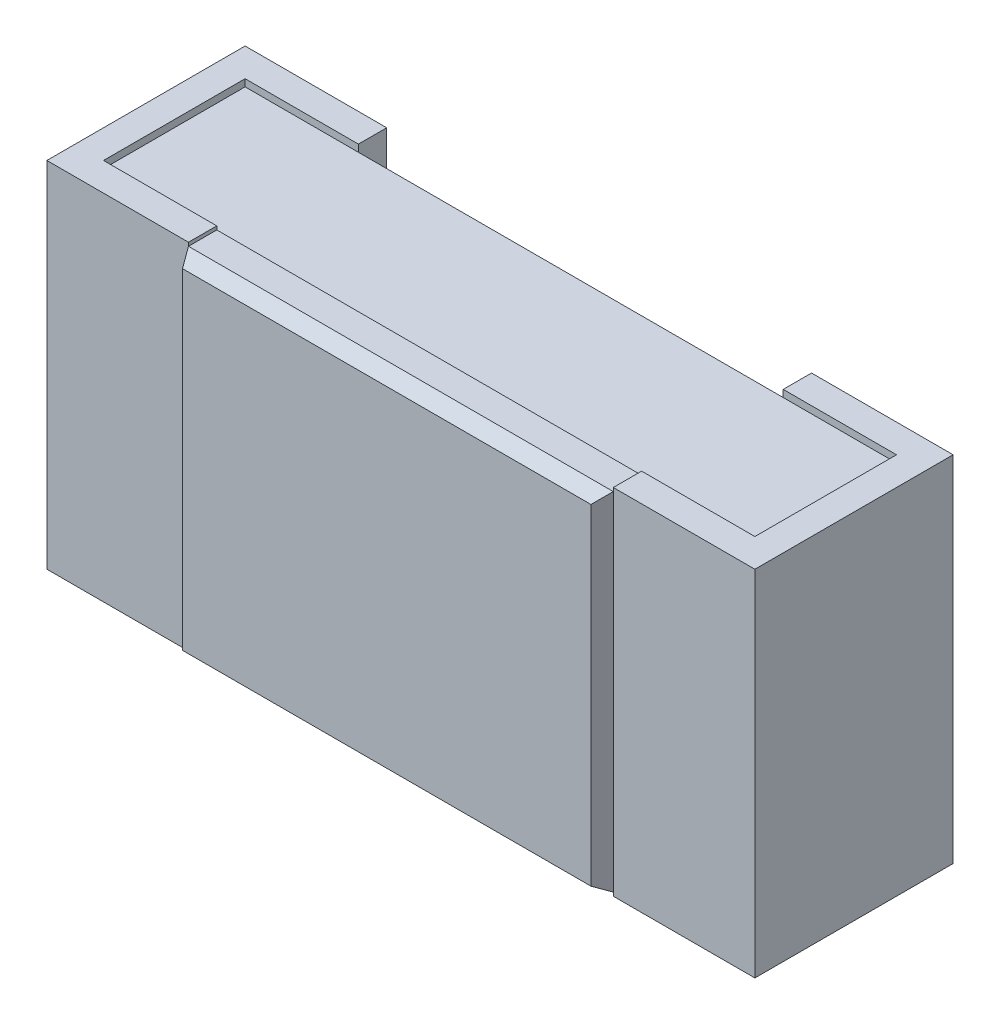
ISO-10303-21;
HEADER;
FILE_DESCRIPTION(('STEP AP214'),'2;1');
FILE_NAME('part.step','',(''),(''),'','','');
FILE_SCHEMA(('AUTOMOTIVE_DESIGN { 1 0 10303 214 1 1 1 1 }'));
ENDSEC;
DATA;
#1=APPLICATION_CONTEXT('core data for automotive mechanical design processes');
#2=APPLICATION_PROTOCOL_DEFINITION('international standard','automotive_design',2000,#1);
#3=PRODUCT_CONTEXT('',#1,'mechanical');
#4=PRODUCT('Part','Part','',(#3));
#5=PRODUCT_RELATED_PRODUCT_CATEGORY('part','',(#4));
#6=PRODUCT_DEFINITION_FORMATION('','',#4);
#7=PRODUCT_DEFINITION_CONTEXT('part definition',#1,'design');
#8=PRODUCT_DEFINITION('design','',#6,#7);
#9=PRODUCT_DEFINITION_SHAPE('','',#8);
#10=(LENGTH_UNIT() NAMED_UNIT(*) SI_UNIT(.MILLI.,.METRE.));
#11=(NAMED_UNIT(*) PLANE_ANGLE_UNIT() SI_UNIT($,.RADIAN.));
#12=(NAMED_UNIT(*) SI_UNIT($,.STERADIAN.) SOLID_ANGLE_UNIT());
#13=UNCERTAINTY_MEASURE_WITH_UNIT(LENGTH_MEASURE(1.E-05),#10,'distance_accuracy_value','');
#14=(GEOMETRIC_REPRESENTATION_CONTEXT(3) GLOBAL_UNCERTAINTY_ASSIGNED_CONTEXT((#13)) GLOBAL_UNIT_ASSIGNED_CONTEXT((#10,
#11,#12)) REPRESENTATION_CONTEXT('',''));
#15=CARTESIAN_POINT('',(0.,0.,0.));
#16=DIRECTION('',(0.,0.,1.));
#17=DIRECTION('',(1.,0.,0.));
#18=AXIS2_PLACEMENT_3D('',#15,#16,#17);
#19=CARTESIAN_POINT('',(-0.3,-0.25,0.28));
#20=DIRECTION('',(1.,0.,0.));
#21=DIRECTION('',(0.,0.,-1.));
#22=AXIS2_PLACEMENT_3D('',#19,#20,#21);
#23=PLANE('',#22);
#24=DIRECTION('',(0.,0.,1.));
#25=VECTOR('',#24,1.);
#26=CARTESIAN_POINT('',(-0.3,-0.245,0.24));
#27=LINE('',#26,#25);
#28=CARTESIAN_POINT('',(-0.3,-0.245,0.24));
#29=VERTEX_POINT('',#28);
#30=CARTESIAN_POINT('',(-0.3,-0.245,0.28));
#31=VERTEX_POINT('',#30);
#32=EDGE_CURVE('E290',#29,#31,#27,.T.);
#33=ORIENTED_EDGE('',*,*,#32,.T.);
#34=DIRECTION('',(0.,1.,0.));
#35=VECTOR('',#34,1.);
#36=CARTESIAN_POINT('',(-0.3,-0.25,0.28));
#37=LINE('',#36,#35);
#38=CARTESIAN_POINT('',(-0.3,-0.25,0.28));
#39=VERTEX_POINT('',#38);
#40=EDGE_CURVE('E482',#39,#31,#37,.T.);
#41=ORIENTED_EDGE('',*,*,#40,.F.);
#42=DIRECTION('',(0.,0.,-1.));
#43=VECTOR('',#42,1.);
#44=CARTESIAN_POINT('',(-0.3,-0.25,0.28));
#45=LINE('',#44,#43);
#46=CARTESIAN_POINT('',(-0.3,-0.25,0.24));
#47=VERTEX_POINT('',#46);
#48=EDGE_CURVE('E433',#39,#47,#45,.T.);
#49=ORIENTED_EDGE('',*,*,#48,.T.);
#50=DIRECTION('',(0.,1.,0.));
#51=VECTOR('',#50,1.);
#52=CARTESIAN_POINT('',(-0.3,-0.25,0.24));
#53=LINE('',#52,#51);
#54=EDGE_CURVE('E58',#47,#29,#53,.T.);
#55=ORIENTED_EDGE('',*,*,#54,.T.);
#56=EDGE_LOOP('',(#33,#41,#49,#55));
#57=FACE_BOUND('',#56,.T.);
#58=ADVANCED_FACE('F34',(#57),#23,.T.);
#59=CARTESIAN_POINT('',(0.3,-0.25,0.28));
#60=DIRECTION('',(-1.,0.,0.));
#61=DIRECTION('',(0.,0.,1.));
#62=AXIS2_PLACEMENT_3D('',#59,#60,#61);
#63=PLANE('',#62);
#64=DIRECTION('',(0.,0.,1.));
#65=VECTOR('',#64,1.);
#66=CARTESIAN_POINT('',(0.3,-0.245,0.24));
#67=LINE('',#66,#65);
#68=CARTESIAN_POINT('',(0.3,-0.245,0.24));
#69=VERTEX_POINT('',#68);
#70=CARTESIAN_POINT('',(0.3,-0.245,0.28));
#71=VERTEX_POINT('',#70);
#72=EDGE_CURVE('E286',#69,#71,#67,.T.);
#73=ORIENTED_EDGE('',*,*,#72,.F.);
#74=DIRECTION('',(0.,1.,0.));
#75=VECTOR('',#74,1.);
#76=CARTESIAN_POINT('',(0.3,-0.25,0.24));
#77=LINE('',#76,#75);
#78=CARTESIAN_POINT('',(0.3,-0.25,0.24));
#79=VERTEX_POINT('',#78);
#80=EDGE_CURVE('E361',#79,#69,#77,.T.);
#81=ORIENTED_EDGE('',*,*,#80,.F.);
#82=DIRECTION('',(0.,0.,1.));
#83=VECTOR('',#82,1.);
#84=CARTESIAN_POINT('',(0.3,-0.25,0.28));
#85=LINE('',#84,#83);
#86=CARTESIAN_POINT('',(0.3,-0.25,0.28));
#87=VERTEX_POINT('',#86);
#88=EDGE_CURVE('E328',#79,#87,#85,.T.);
#89=ORIENTED_EDGE('',*,*,#88,.T.);
#90=DIRECTION('',(0.,1.,0.));
#91=VECTOR('',#90,1.);
#92=CARTESIAN_POINT('',(0.3,-0.25,0.28));
#93=LINE('',#92,#91);
#94=EDGE_CURVE('E390',#87,#71,#93,.T.);
#95=ORIENTED_EDGE('',*,*,#94,.T.);
#96=EDGE_LOOP('',(#73,#81,#89,#95));
#97=FACE_BOUND('',#96,.T.);
#98=ADVANCED_FACE('F583',(#97),#63,.T.);
#99=CARTESIAN_POINT('',(-0.46,0.24,0.24));
#100=DIRECTION('',(0.,-1.,0.));
#101=DIRECTION('',(0.,0.,-1.));
#102=AXIS2_PLACEMENT_3D('',#99,#100,#101);
#103=PLANE('',#102);
#104=DIRECTION('',(-1.,0.,0.));
#105=VECTOR('',#104,1.);
#106=CARTESIAN_POINT('',(-0.46,0.24,0.04));
#107=LINE('',#106,#105);
#108=CARTESIAN_POINT('',(0.46,0.24,0.04));
#109=VERTEX_POINT('',#108);
#110=CARTESIAN_POINT('',(0.3,0.24,0.04));
#111=VERTEX_POINT('',#110);
#112=EDGE_CURVE('E497',#109,#111,#107,.T.);
#113=ORIENTED_EDGE('',*,*,#112,.T.);
#114=CARTESIAN_POINT('',(-0.3,0.24,0.04));
#115=VERTEX_POINT('',#114);
#116=EDGE_CURVE('E502',#111,#115,#107,.T.);
#117=ORIENTED_EDGE('',*,*,#116,.T.);
#118=CARTESIAN_POINT('',(-0.46,0.24,0.04));
#119=VERTEX_POINT('',#118);
#120=EDGE_CURVE('E460',#115,#119,#107,.T.);
#121=ORIENTED_EDGE('',*,*,#120,.T.);
#122=DIRECTION('',(0.,0.,-1.));
#123=VECTOR('',#122,1.);
#124=CARTESIAN_POINT('',(-0.46,0.24,0.24));
#125=LINE('',#124,#123);
#126=CARTESIAN_POINT('',(-0.46,0.24,0.24));
#127=VERTEX_POINT('',#126);
#128=EDGE_CURVE('E513',#127,#119,#125,.T.);
#129=ORIENTED_EDGE('',*,*,#128,.F.);
#130=DIRECTION('',(-1.,0.,0.));
#131=VECTOR('',#130,1.);
#132=CARTESIAN_POINT('',(-0.46,0.24,0.24));
#133=LINE('',#132,#131);
#134=CARTESIAN_POINT('',(0.46,0.24,0.24));
#135=VERTEX_POINT('',#134);
#136=EDGE_CURVE('E489',#135,#127,#133,.T.);
#137=ORIENTED_EDGE('',*,*,#136,.F.);
#138=DIRECTION('',(0.,0.,-1.));
#139=VECTOR('',#138,1.);
#140=CARTESIAN_POINT('',(0.46,0.24,0.24));
#141=LINE('',#140,#139);
#142=EDGE_CURVE('E516',#135,#109,#141,.T.);
#143=ORIENTED_EDGE('',*,*,#142,.T.);
#144=EDGE_LOOP('',(#113,#117,#121,#129,#137,#143));
#145=FACE_BOUND('',#144,.T.);
#146=ADVANCED_FACE('F36',(#145),#103,.F.);
#147=CARTESIAN_POINT('',(-0.46,-0.24,0.24));
#148=DIRECTION('',(0.,1.,0.));
#149=DIRECTION('',(0.,0.,1.));
#150=AXIS2_PLACEMENT_3D('',#147,#148,#149);
#151=PLANE('',#150);
#152=DIRECTION('',(1.,0.,0.));
#153=VECTOR('',#152,1.);
#154=CARTESIAN_POINT('',(-0.46,-0.24,0.04));
#155=LINE('',#154,#153);
#156=CARTESIAN_POINT('',(-0.46,-0.24,0.04));
#157=VERTEX_POINT('',#156);
#158=CARTESIAN_POINT('',(-0.3,-0.24,0.04));
#159=VERTEX_POINT('',#158);
#160=EDGE_CURVE('E493',#157,#159,#155,.T.);
#161=ORIENTED_EDGE('',*,*,#160,.T.);
#162=CARTESIAN_POINT('',(0.3,-0.24,0.04));
#163=VERTEX_POINT('',#162);
#164=EDGE_CURVE('E506',#159,#163,#155,.T.);
#165=ORIENTED_EDGE('',*,*,#164,.T.);
#166=CARTESIAN_POINT('',(0.46,-0.24,0.04));
#167=VERTEX_POINT('',#166);
#168=EDGE_CURVE('E501',#163,#167,#155,.T.);
#169=ORIENTED_EDGE('',*,*,#168,.T.);
#170=DIRECTION('',(0.,0.,-1.));
#171=VECTOR('',#170,1.);
#172=CARTESIAN_POINT('',(0.46,-0.24,0.24));
#173=LINE('',#172,#171);
#174=CARTESIAN_POINT('',(0.46,-0.24,0.24));
#175=VERTEX_POINT('',#174);
#176=EDGE_CURVE('E496',#175,#167,#173,.T.);
#177=ORIENTED_EDGE('',*,*,#176,.F.);
#178=DIRECTION('',(1.,0.,0.));
#179=VECTOR('',#178,1.);
#180=CARTESIAN_POINT('',(-0.46,-0.24,0.24));
#181=LINE('',#180,#179);
#182=CARTESIAN_POINT('',(-0.46,-0.24,0.24));
#183=VERTEX_POINT('',#182);
#184=EDGE_CURVE('E492',#183,#175,#181,.T.);
#185=ORIENTED_EDGE('',*,*,#184,.F.);
#186=DIRECTION('',(0.,0.,-1.));
#187=VECTOR('',#186,1.);
#188=CARTESIAN_POINT('',(-0.46,-0.24,0.24));
#189=LINE('',#188,#187);
#190=EDGE_CURVE('E509',#183,#157,#189,.T.);
#191=ORIENTED_EDGE('',*,*,#190,.T.);
#192=EDGE_LOOP('',(#161,#165,#169,#177,#185,#191));
#193=FACE_BOUND('',#192,.T.);
#194=ADVANCED_FACE('F549',(#193),#151,.F.);
#195=CARTESIAN_POINT('',(0.46,-0.24,0.04));
#196=DIRECTION('',(0.,0.,1.));
#197=DIRECTION('',(1.,0.,0.));
#198=AXIS2_PLACEMENT_3D('',#195,#196,#197);
#199=PLANE('',#198);
#200=ORIENTED_EDGE('',*,*,#116,.F.);
#201=DIRECTION('',(0.,-1.,0.));
#202=VECTOR('',#201,1.);
#203=CARTESIAN_POINT('',(0.3,-0.24,0.04));
#204=LINE('',#203,#202);
#205=EDGE_CURVE('E11',#111,#163,#204,.T.);
#206=ORIENTED_EDGE('',*,*,#205,.T.);
#207=ORIENTED_EDGE('',*,*,#164,.F.);
#208=DIRECTION('',(0.,1.,0.));
#209=VECTOR('',#208,1.);
#210=CARTESIAN_POINT('',(-0.3,-0.24,0.04));
#211=LINE('',#210,#209);
#212=EDGE_CURVE('E43',#159,#115,#211,.T.);
#213=ORIENTED_EDGE('',*,*,#212,.T.);
#214=EDGE_LOOP('',(#200,#206,#207,#213));
#215=FACE_BOUND('',#214,.T.);
#216=ADVANCED_FACE('F525',(#215),#199,.F.);
#217=CARTESIAN_POINT('',(-0.46,-0.25,0.04));
#218=DIRECTION('',(0.,0.,1.));
#219=DIRECTION('',(1.,0.,0.));
#220=AXIS2_PLACEMENT_3D('',#217,#218,#219);
#221=PLANE('',#220);
#222=ORIENTED_EDGE('',*,*,#120,.F.);
#223=DIRECTION('',(0.,1.,0.));
#224=VECTOR('',#223,1.);
#225=CARTESIAN_POINT('',(-0.3,-0.25,0.04));
#226=LINE('',#225,#224);
#227=CARTESIAN_POINT('',(-0.3,0.25,0.04));
#228=VERTEX_POINT('',#227);
#229=EDGE_CURVE('E468',#115,#228,#226,.T.);
#230=ORIENTED_EDGE('',*,*,#229,.T.);
#231=DIRECTION('',(1.,0.,0.));
#232=VECTOR('',#231,1.);
#233=CARTESIAN_POINT('',(-0.46,0.25,0.04));
#234=LINE('',#233,#232);
#235=CARTESIAN_POINT('',(-0.46,0.25,0.04));
#236=VERTEX_POINT('',#235);
#237=EDGE_CURVE('E413',#236,#228,#234,.T.);
#238=ORIENTED_EDGE('',*,*,#237,.F.);
#239=DIRECTION('',(0.,1.,0.));
#240=VECTOR('',#239,1.);
#241=CARTESIAN_POINT('',(-0.46,-0.25,0.04));
#242=LINE('',#241,#240);
#243=EDGE_CURVE('E473',#119,#236,#242,.T.);
#244=ORIENTED_EDGE('',*,*,#243,.F.);
#245=EDGE_LOOP('',(#222,#230,#238,#244));
#246=FACE_BOUND('',#245,.T.);
#247=ADVANCED_FACE('F636',(#246),#221,.T.);
#248=ORIENTED_EDGE('',*,*,#160,.F.);
#249=CARTESIAN_POINT('',(-0.46,-0.25,0.04));
#250=VERTEX_POINT('',#249);
#251=EDGE_CURVE('E469',#250,#157,#242,.T.);
#252=ORIENTED_EDGE('',*,*,#251,.F.);
#253=DIRECTION('',(1.,0.,0.));
#254=VECTOR('',#253,1.);
#255=CARTESIAN_POINT('',(-0.46,-0.25,0.04));
#256=LINE('',#255,#254);
#257=CARTESIAN_POINT('',(-0.3,-0.25,0.04));
#258=VERTEX_POINT('',#257);
#259=EDGE_CURVE('E444',#250,#258,#256,.T.);
#260=ORIENTED_EDGE('',*,*,#259,.T.);
#261=EDGE_CURVE('E464',#258,#159,#226,.T.);
#262=ORIENTED_EDGE('',*,*,#261,.T.);
#263=EDGE_LOOP('',(#248,#252,#260,#262));
#264=FACE_BOUND('',#263,.T.);
#265=ADVANCED_FACE('F534',(#264),#221,.T.);
#266=CARTESIAN_POINT('',(-0.3,-0.25,0.24));
#267=DIRECTION('',(0.,0.,-1.));
#268=DIRECTION('',(-1.,0.,0.));
#269=AXIS2_PLACEMENT_3D('',#266,#267,#268);
#270=PLANE('',#269);
#271=ORIENTED_EDGE('',*,*,#136,.T.);
#272=DIRECTION('',(0.,1.,0.));
#273=VECTOR('',#272,1.);
#274=CARTESIAN_POINT('',(-0.46,-0.25,0.24));
#275=LINE('',#274,#273);
#276=CARTESIAN_POINT('',(-0.46,0.25,0.24));
#277=VERTEX_POINT('',#276);
#278=EDGE_CURVE('E478',#127,#277,#275,.T.);
#279=ORIENTED_EDGE('',*,*,#278,.T.);
#280=DIRECTION('',(-1.,0.,0.));
#281=VECTOR('',#280,1.);
#282=CARTESIAN_POINT('',(-0.3,0.25,0.24));
#283=LINE('',#282,#281);
#284=CARTESIAN_POINT('',(-0.3,0.25,0.24));
#285=VERTEX_POINT('',#284);
#286=EDGE_CURVE('E405',#285,#277,#283,.T.);
#287=ORIENTED_EDGE('',*,*,#286,.F.);
#288=CARTESIAN_POINT('',(-0.3,0.245,0.24));
#289=VERTEX_POINT('',#288);
#290=EDGE_CURVE('E481',#289,#285,#53,.T.);
#291=ORIENTED_EDGE('',*,*,#290,.F.);
#292=DIRECTION('',(-1.,0.,0.));
#293=VECTOR('',#292,1.);
#294=CARTESIAN_POINT('',(-0.3,0.245,0.24));
#295=LINE('',#294,#293);
#296=CARTESIAN_POINT('',(0.3,0.245,0.24));
#297=VERTEX_POINT('',#296);
#298=EDGE_CURVE('E267',#297,#289,#295,.T.);
#299=ORIENTED_EDGE('',*,*,#298,.F.);
#300=CARTESIAN_POINT('',(0.3,0.25,0.24));
#301=VERTEX_POINT('',#300);
#302=EDGE_CURVE('E366',#297,#301,#77,.T.);
#303=ORIENTED_EDGE('',*,*,#302,.T.);
#304=DIRECTION('',(-1.,0.,0.));
#305=VECTOR('',#304,1.);
#306=CARTESIAN_POINT('',(0.3,0.25,0.24));
#307=LINE('',#306,#305);
#308=CARTESIAN_POINT('',(0.46,0.25,0.24));
#309=VERTEX_POINT('',#308);
#310=EDGE_CURVE('E324',#309,#301,#307,.T.);
#311=ORIENTED_EDGE('',*,*,#310,.F.);
#312=DIRECTION('',(0.,1.,0.));
#313=VECTOR('',#312,1.);
#314=CARTESIAN_POINT('',(0.46,-0.25,0.24));
#315=LINE('',#314,#313);
#316=EDGE_CURVE('E371',#135,#309,#315,.T.);
#317=ORIENTED_EDGE('',*,*,#316,.F.);
#318=EDGE_LOOP('',(#271,#279,#287,#291,#299,#303,#311,#317));
#319=FACE_BOUND('',#318,.T.);
#320=ADVANCED_FACE('F603',(#319),#270,.T.);
#321=ORIENTED_EDGE('',*,*,#184,.T.);
#322=CARTESIAN_POINT('',(0.46,-0.25,0.24));
#323=VERTEX_POINT('',#322);
#324=EDGE_CURVE('E367',#323,#175,#315,.T.);
#325=ORIENTED_EDGE('',*,*,#324,.F.);
#326=DIRECTION('',(-1.,0.,0.));
#327=VECTOR('',#326,1.);
#328=CARTESIAN_POINT('',(0.3,-0.25,0.24));
#329=LINE('',#328,#327);
#330=EDGE_CURVE('E356',#323,#79,#329,.T.);
#331=ORIENTED_EDGE('',*,*,#330,.T.);
#332=ORIENTED_EDGE('',*,*,#80,.T.);
#333=DIRECTION('',(1.,0.,0.));
#334=VECTOR('',#333,1.);
#335=CARTESIAN_POINT('',(-0.3,-0.245,0.24));
#336=LINE('',#335,#334);
#337=EDGE_CURVE('E271',#29,#69,#336,.T.);
#338=ORIENTED_EDGE('',*,*,#337,.F.);
#339=ORIENTED_EDGE('',*,*,#54,.F.);
#340=DIRECTION('',(-1.,0.,0.));
#341=VECTOR('',#340,1.);
#342=CARTESIAN_POINT('',(-0.3,-0.25,0.24));
#343=LINE('',#342,#341);
#344=CARTESIAN_POINT('',(-0.46,-0.25,0.24));
#345=VERTEX_POINT('',#344);
#346=EDGE_CURVE('E436',#47,#345,#343,.T.);
#347=ORIENTED_EDGE('',*,*,#346,.T.);
#348=EDGE_CURVE('E474',#345,#183,#275,.T.);
#349=ORIENTED_EDGE('',*,*,#348,.T.);
#350=EDGE_LOOP('',(#321,#325,#331,#332,#338,#339,#347,#349));
#351=FACE_BOUND('',#350,.T.);
#352=ADVANCED_FACE('F546',(#351),#270,.T.);
#353=CARTESIAN_POINT('',(-0.46,-0.25,0.04));
#354=DIRECTION('',(1.,0.,0.));
#355=DIRECTION('',(0.,0.,-1.));
#356=AXIS2_PLACEMENT_3D('',#353,#354,#355);
#357=PLANE('',#356);
#358=ORIENTED_EDGE('',*,*,#128,.T.);
#359=ORIENTED_EDGE('',*,*,#243,.T.);
#360=DIRECTION('',(0.,0.,-1.));
#361=VECTOR('',#360,1.);
#362=CARTESIAN_POINT('',(-0.46,0.25,0.04));
#363=LINE('',#362,#361);
#364=EDGE_CURVE('E409',#277,#236,#363,.T.);
#365=ORIENTED_EDGE('',*,*,#364,.F.);
#366=ORIENTED_EDGE('',*,*,#278,.F.);
#367=EDGE_LOOP('',(#358,#359,#365,#366));
#368=FACE_BOUND('',#367,.T.);
#369=ADVANCED_FACE('F632',(#368),#357,.T.);
#370=ORIENTED_EDGE('',*,*,#190,.F.);
#371=ORIENTED_EDGE('',*,*,#348,.F.);
#372=DIRECTION('',(0.,0.,-1.));
#373=VECTOR('',#372,1.);
#374=CARTESIAN_POINT('',(-0.46,-0.25,0.04));
#375=LINE('',#374,#373);
#376=EDGE_CURVE('E440',#345,#250,#375,.T.);
#377=ORIENTED_EDGE('',*,*,#376,.T.);
#378=ORIENTED_EDGE('',*,*,#251,.T.);
#379=EDGE_LOOP('',(#370,#371,#377,#378));
#380=FACE_BOUND('',#379,.T.);
#381=ADVANCED_FACE('F543',(#380),#357,.T.);
#382=CARTESIAN_POINT('',(-0.5,-0.25,0.));
#383=DIRECTION('',(-1.,0.,0.));
#384=DIRECTION('',(0.,0.,1.));
#385=AXIS2_PLACEMENT_3D('',#382,#383,#384);
#386=PLANE('',#385);
#387=DIRECTION('',(0.,1.,0.));
#388=VECTOR('',#387,1.);
#389=CARTESIAN_POINT('',(-0.5,-0.25,0.28));
#390=LINE('',#389,#388);
#391=CARTESIAN_POINT('',(-0.5,-0.25,0.28));
#392=VERTEX_POINT('',#391);
#393=CARTESIAN_POINT('',(-0.5,0.25,0.28));
#394=VERTEX_POINT('',#393);
#395=EDGE_CURVE('E456',#392,#394,#390,.T.);
#396=ORIENTED_EDGE('',*,*,#395,.T.);
#397=DIRECTION('',(0.,0.,1.));
#398=VECTOR('',#397,1.);
#399=CARTESIAN_POINT('',(-0.5,0.25,0.));
#400=LINE('',#399,#398);
#401=CARTESIAN_POINT('',(-0.5,0.25,0.));
#402=VERTEX_POINT('',#401);
#403=EDGE_CURVE('E365',#402,#394,#400,.T.);
#404=ORIENTED_EDGE('',*,*,#403,.F.);
#405=DIRECTION('',(0.,1.,0.));
#406=VECTOR('',#405,1.);
#407=CARTESIAN_POINT('',(-0.5,-0.25,0.));
#408=LINE('',#407,#406);
#409=CARTESIAN_POINT('',(-0.5,-0.25,0.));
#410=VERTEX_POINT('',#409);
#411=EDGE_CURVE('E457',#410,#402,#408,.T.);
#412=ORIENTED_EDGE('',*,*,#411,.F.);
#413=DIRECTION('',(0.,0.,1.));
#414=VECTOR('',#413,1.);
#415=CARTESIAN_POINT('',(-0.5,-0.25,0.));
#416=LINE('',#415,#414);
#417=EDGE_CURVE('E425',#410,#392,#416,.T.);
#418=ORIENTED_EDGE('',*,*,#417,.T.);
#419=EDGE_LOOP('',(#396,#404,#412,#418));
#420=FACE_BOUND('',#419,.T.);
#421=ADVANCED_FACE('F646',(#420),#386,.T.);
#422=CARTESIAN_POINT('',(-0.5,-0.25,0.));
#423=DIRECTION('',(0.,0.,-1.));
#424=DIRECTION('',(-1.,0.,0.));
#425=AXIS2_PLACEMENT_3D('',#422,#423,#424);
#426=PLANE('',#425);
#427=ORIENTED_EDGE('',*,*,#411,.T.);
#428=DIRECTION('',(-1.,0.,0.));
#429=VECTOR('',#428,1.);
#430=CARTESIAN_POINT('',(-0.5,0.25,0.));
#431=LINE('',#430,#429);
#432=CARTESIAN_POINT('',(-0.3,0.25,0.));
#433=VERTEX_POINT('',#432);
#434=EDGE_CURVE('E421',#433,#402,#431,.T.);
#435=ORIENTED_EDGE('',*,*,#434,.F.);
#436=DIRECTION('',(0.,1.,0.));
#437=VECTOR('',#436,1.);
#438=CARTESIAN_POINT('',(-0.3,-0.25,0.));
#439=LINE('',#438,#437);
#440=CARTESIAN_POINT('',(-0.3,-0.25,0.));
#441=VERTEX_POINT('',#440);
#442=EDGE_CURVE('E461',#441,#433,#439,.T.);
#443=ORIENTED_EDGE('',*,*,#442,.F.);
#444=DIRECTION('',(-1.,0.,0.));
#445=VECTOR('',#444,1.);
#446=CARTESIAN_POINT('',(-0.5,-0.25,0.));
#447=LINE('',#446,#445);
#448=EDGE_CURVE('E452',#441,#410,#447,.T.);
#449=ORIENTED_EDGE('',*,*,#448,.T.);
#450=EDGE_LOOP('',(#427,#435,#443,#449));
#451=FACE_BOUND('',#450,.T.);
#452=ADVANCED_FACE('F643',(#451),#426,.T.);
#453=CARTESIAN_POINT('',(-0.3,-0.25,0.));
#454=DIRECTION('',(1.,0.,0.));
#455=DIRECTION('',(0.,0.,-1.));
#456=AXIS2_PLACEMENT_3D('',#453,#454,#455);
#457=PLANE('',#456);
#458=ORIENTED_EDGE('',*,*,#442,.T.);
#459=DIRECTION('',(0.,0.,-1.));
#460=VECTOR('',#459,1.);
#461=CARTESIAN_POINT('',(-0.3,0.25,0.));
#462=LINE('',#461,#460);
#463=EDGE_CURVE('E417',#228,#433,#462,.T.);
#464=ORIENTED_EDGE('',*,*,#463,.F.);
#465=ORIENTED_EDGE('',*,*,#229,.F.);
#466=ORIENTED_EDGE('',*,*,#212,.F.);
#467=ORIENTED_EDGE('',*,*,#261,.F.);
#468=DIRECTION('',(0.,0.,-1.));
#469=VECTOR('',#468,1.);
#470=CARTESIAN_POINT('',(-0.3,-0.25,0.));
#471=LINE('',#470,#469);
#472=EDGE_CURVE('E448',#258,#441,#471,.T.);
#473=ORIENTED_EDGE('',*,*,#472,.T.);
#474=EDGE_LOOP('',(#458,#464,#465,#466,#467,#473));
#475=FACE_BOUND('',#474,.T.);
#476=ADVANCED_FACE('F529',(#475),#457,.T.);
#477=DIRECTION('',(0.,0.,1.));
#478=VECTOR('',#477,1.);
#479=CARTESIAN_POINT('',(-0.3,0.245,0.24));
#480=LINE('',#479,#478);
#481=CARTESIAN_POINT('',(-0.3,0.245,0.28));
#482=VERTEX_POINT('',#481);
#483=EDGE_CURVE('E50',#289,#482,#480,.T.);
#484=ORIENTED_EDGE('',*,*,#483,.F.);
#485=ORIENTED_EDGE('',*,*,#290,.T.);
#486=DIRECTION('',(0.,0.,-1.));
#487=VECTOR('',#486,1.);
#488=CARTESIAN_POINT('',(-0.3,0.25,0.28));
#489=LINE('',#488,#487);
#490=CARTESIAN_POINT('',(-0.3,0.25,0.28));
#491=VERTEX_POINT('',#490);
#492=EDGE_CURVE('E401',#491,#285,#489,.T.);
#493=ORIENTED_EDGE('',*,*,#492,.F.);
#494=EDGE_CURVE('E486',#482,#491,#37,.T.);
#495=ORIENTED_EDGE('',*,*,#494,.F.);
#496=EDGE_LOOP('',(#484,#485,#493,#495));
#497=FACE_BOUND('',#496,.T.);
#498=ADVANCED_FACE('F648',(#497),#23,.T.);
#499=CARTESIAN_POINT('',(-0.5,-0.25,0.28));
#500=DIRECTION('',(0.,0.,1.));
#501=DIRECTION('',(1.,0.,0.));
#502=AXIS2_PLACEMENT_3D('',#499,#500,#501);
#503=PLANE('',#502);
#504=ORIENTED_EDGE('',*,*,#40,.T.);
#505=DIRECTION('',(0.,-1.,0.));
#506=VECTOR('',#505,1.);
#507=CARTESIAN_POINT('',(-0.3,0.245,0.28));
#508=LINE('',#507,#506);
#509=EDGE_CURVE('E279',#482,#31,#508,.T.);
#510=ORIENTED_EDGE('',*,*,#509,.F.);
#511=ORIENTED_EDGE('',*,*,#494,.T.);
#512=DIRECTION('',(1.,0.,0.));
#513=VECTOR('',#512,1.);
#514=CARTESIAN_POINT('',(-0.5,0.25,0.28));
#515=LINE('',#514,#513);
#516=EDGE_CURVE('E397',#394,#491,#515,.T.);
#517=ORIENTED_EDGE('',*,*,#516,.F.);
#518=ORIENTED_EDGE('',*,*,#395,.F.);
#519=DIRECTION('',(1.,0.,0.));
#520=VECTOR('',#519,1.);
#521=CARTESIAN_POINT('',(-0.5,-0.25,0.28));
#522=LINE('',#521,#520);
#523=EDGE_CURVE('E429',#392,#39,#522,.T.);
#524=ORIENTED_EDGE('',*,*,#523,.T.);
#525=EDGE_LOOP('',(#504,#510,#511,#517,#518,#524));
#526=FACE_BOUND('',#525,.T.);
#527=ADVANCED_FACE('F595',(#526),#503,.T.);
#528=CARTESIAN_POINT('',(-0.5,-0.25,0.28));
#529=DIRECTION('',(0.,1.,0.));
#530=DIRECTION('',(0.,0.,1.));
#531=AXIS2_PLACEMENT_3D('',#528,#529,#530);
#532=PLANE('',#531);
#533=ORIENTED_EDGE('',*,*,#417,.F.);
#534=ORIENTED_EDGE('',*,*,#448,.F.);
#535=ORIENTED_EDGE('',*,*,#472,.F.);
#536=ORIENTED_EDGE('',*,*,#259,.F.);
#537=ORIENTED_EDGE('',*,*,#376,.F.);
#538=ORIENTED_EDGE('',*,*,#346,.F.);
#539=ORIENTED_EDGE('',*,*,#48,.F.);
#540=ORIENTED_EDGE('',*,*,#523,.F.);
#541=EDGE_LOOP('',(#533,#534,#535,#536,#537,#538,#539,#540));
#542=FACE_BOUND('',#541,.T.);
#543=ADVANCED_FACE('F539',(#542),#532,.F.);
#544=CARTESIAN_POINT('',(-0.5,0.25,0.28));
#545=DIRECTION('',(0.,1.,0.));
#546=DIRECTION('',(0.,0.,1.));
#547=AXIS2_PLACEMENT_3D('',#544,#545,#546);
#548=PLANE('',#547);
#549=ORIENTED_EDGE('',*,*,#403,.T.);
#550=ORIENTED_EDGE('',*,*,#516,.T.);
#551=ORIENTED_EDGE('',*,*,#492,.T.);
#552=ORIENTED_EDGE('',*,*,#286,.T.);
#553=ORIENTED_EDGE('',*,*,#364,.T.);
#554=ORIENTED_EDGE('',*,*,#237,.T.);
#555=ORIENTED_EDGE('',*,*,#463,.T.);
#556=ORIENTED_EDGE('',*,*,#434,.T.);
#557=EDGE_LOOP('',(#549,#550,#551,#552,#553,#554,#555,#556));
#558=FACE_BOUND('',#557,.T.);
#559=ADVANCED_FACE('F640',(#558),#548,.T.);
#560=CARTESIAN_POINT('',(0.46,-0.25,0.04));
#561=DIRECTION('',(0.,0.,1.));
#562=DIRECTION('',(1.,0.,0.));
#563=AXIS2_PLACEMENT_3D('',#560,#561,#562);
#564=PLANE('',#563);
#565=ORIENTED_EDGE('',*,*,#112,.F.);
#566=DIRECTION('',(0.,1.,0.));
#567=VECTOR('',#566,1.);
#568=CARTESIAN_POINT('',(0.46,-0.25,0.04));
#569=LINE('',#568,#567);
#570=CARTESIAN_POINT('',(0.46,0.25,0.04));
#571=VERTEX_POINT('',#570);
#572=EDGE_CURVE('E376',#109,#571,#569,.T.);
#573=ORIENTED_EDGE('',*,*,#572,.T.);
#574=DIRECTION('',(1.,0.,0.));
#575=VECTOR('',#574,1.);
#576=CARTESIAN_POINT('',(0.46,0.25,0.04));
#577=LINE('',#576,#575);
#578=CARTESIAN_POINT('',(0.3,0.25,0.04));
#579=VERTEX_POINT('',#578);
#580=EDGE_CURVE('E316',#579,#571,#577,.T.);
#581=ORIENTED_EDGE('',*,*,#580,.F.);
#582=DIRECTION('',(0.,1.,0.));
#583=VECTOR('',#582,1.);
#584=CARTESIAN_POINT('',(0.3,-0.25,0.04));
#585=LINE('',#584,#583);
#586=EDGE_CURVE('E380',#111,#579,#585,.T.);
#587=ORIENTED_EDGE('',*,*,#586,.F.);
#588=EDGE_LOOP('',(#565,#573,#581,#587));
#589=FACE_BOUND('',#588,.T.);
#590=ADVANCED_FACE('F618',(#589),#564,.T.);
#591=ORIENTED_EDGE('',*,*,#168,.F.);
#592=CARTESIAN_POINT('',(0.3,-0.25,0.04));
#593=VERTEX_POINT('',#592);
#594=EDGE_CURVE('E377',#593,#163,#585,.T.);
#595=ORIENTED_EDGE('',*,*,#594,.F.);
#596=DIRECTION('',(1.,0.,0.));
#597=VECTOR('',#596,1.);
#598=CARTESIAN_POINT('',(0.46,-0.25,0.04));
#599=LINE('',#598,#597);
#600=CARTESIAN_POINT('',(0.46,-0.25,0.04));
#601=VERTEX_POINT('',#600);
#602=EDGE_CURVE('E348',#593,#601,#599,.T.);
#603=ORIENTED_EDGE('',*,*,#602,.T.);
#604=EDGE_CURVE('E372',#601,#167,#569,.T.);
#605=ORIENTED_EDGE('',*,*,#604,.T.);
#606=EDGE_LOOP('',(#591,#595,#603,#605));
#607=FACE_BOUND('',#606,.T.);
#608=ADVANCED_FACE('F556',(#607),#564,.T.);
#609=CARTESIAN_POINT('',(0.46,-0.25,0.04));
#610=DIRECTION('',(-1.,0.,0.));
#611=DIRECTION('',(0.,0.,1.));
#612=AXIS2_PLACEMENT_3D('',#609,#610,#611);
#613=PLANE('',#612);
#614=ORIENTED_EDGE('',*,*,#142,.F.);
#615=ORIENTED_EDGE('',*,*,#316,.T.);
#616=DIRECTION('',(0.,0.,1.));
#617=VECTOR('',#616,1.);
#618=CARTESIAN_POINT('',(0.46,0.25,0.04));
#619=LINE('',#618,#617);
#620=EDGE_CURVE('E320',#571,#309,#619,.T.);
#621=ORIENTED_EDGE('',*,*,#620,.F.);
#622=ORIENTED_EDGE('',*,*,#572,.F.);
#623=EDGE_LOOP('',(#614,#615,#621,#622));
#624=FACE_BOUND('',#623,.T.);
#625=ADVANCED_FACE('F621',(#624),#613,.T.);
#626=ORIENTED_EDGE('',*,*,#176,.T.);
#627=ORIENTED_EDGE('',*,*,#604,.F.);
#628=DIRECTION('',(0.,0.,1.));
#629=VECTOR('',#628,1.);
#630=CARTESIAN_POINT('',(0.46,-0.25,0.04));
#631=LINE('',#630,#629);
#632=EDGE_CURVE('E352',#601,#323,#631,.T.);
#633=ORIENTED_EDGE('',*,*,#632,.T.);
#634=ORIENTED_EDGE('',*,*,#324,.T.);
#635=EDGE_LOOP('',(#626,#627,#633,#634));
#636=FACE_BOUND('',#635,.T.);
#637=ADVANCED_FACE('F553',(#636),#613,.T.);
#638=DIRECTION('',(0.,0.,1.));
#639=VECTOR('',#638,1.);
#640=CARTESIAN_POINT('',(0.3,0.245,0.24));
#641=LINE('',#640,#639);
#642=CARTESIAN_POINT('',(0.3,0.245,0.28));
#643=VERTEX_POINT('',#642);
#644=EDGE_CURVE('E275',#297,#643,#641,.T.);
#645=ORIENTED_EDGE('',*,*,#644,.T.);
#646=CARTESIAN_POINT('',(0.3,0.25,0.28));
#647=VERTEX_POINT('',#646);
#648=EDGE_CURVE('E360',#643,#647,#93,.T.);
#649=ORIENTED_EDGE('',*,*,#648,.T.);
#650=DIRECTION('',(0.,0.,1.));
#651=VECTOR('',#650,1.);
#652=CARTESIAN_POINT('',(0.3,0.25,0.28));
#653=LINE('',#652,#651);
#654=EDGE_CURVE('E289',#301,#647,#653,.T.);
#655=ORIENTED_EDGE('',*,*,#654,.F.);
#656=ORIENTED_EDGE('',*,*,#302,.F.);
#657=EDGE_LOOP('',(#645,#649,#655,#656));
#658=FACE_BOUND('',#657,.T.);
#659=ADVANCED_FACE('F628',(#658),#63,.T.);
#660=CARTESIAN_POINT('',(0.3,-0.25,0.));
#661=DIRECTION('',(-1.,0.,0.));
#662=DIRECTION('',(0.,0.,1.));
#663=AXIS2_PLACEMENT_3D('',#660,#661,#662);
#664=PLANE('',#663);
#665=ORIENTED_EDGE('',*,*,#594,.T.);
#666=ORIENTED_EDGE('',*,*,#205,.F.);
#667=ORIENTED_EDGE('',*,*,#586,.T.);
#668=DIRECTION('',(0.,0.,1.));
#669=VECTOR('',#668,1.);
#670=CARTESIAN_POINT('',(0.3,0.25,0.));
#671=LINE('',#670,#669);
#672=CARTESIAN_POINT('',(0.3,0.25,0.));
#673=VERTEX_POINT('',#672);
#674=EDGE_CURVE('E312',#673,#579,#671,.T.);
#675=ORIENTED_EDGE('',*,*,#674,.F.);
#676=DIRECTION('',(0.,1.,0.));
#677=VECTOR('',#676,1.);
#678=CARTESIAN_POINT('',(0.3,-0.25,0.));
#679=LINE('',#678,#677);
#680=CARTESIAN_POINT('',(0.3,-0.25,0.));
#681=VERTEX_POINT('',#680);
#682=EDGE_CURVE('E381',#681,#673,#679,.T.);
#683=ORIENTED_EDGE('',*,*,#682,.F.);
#684=DIRECTION('',(0.,0.,1.));
#685=VECTOR('',#684,1.);
#686=CARTESIAN_POINT('',(0.3,-0.25,0.));
#687=LINE('',#686,#685);
#688=EDGE_CURVE('E344',#681,#593,#687,.T.);
#689=ORIENTED_EDGE('',*,*,#688,.T.);
#690=EDGE_LOOP('',(#665,#666,#667,#675,#683,#689));
#691=FACE_BOUND('',#690,.T.);
#692=ADVANCED_FACE('F565',(#691),#664,.T.);
#693=CARTESIAN_POINT('',(0.5,-0.25,0.));
#694=DIRECTION('',(0.,0.,-1.));
#695=DIRECTION('',(-1.,0.,0.));
#696=AXIS2_PLACEMENT_3D('',#693,#694,#695);
#697=PLANE('',#696);
#698=ORIENTED_EDGE('',*,*,#682,.T.);
#699=DIRECTION('',(-1.,0.,0.));
#700=VECTOR('',#699,1.);
#701=CARTESIAN_POINT('',(0.5,0.25,0.));
#702=LINE('',#701,#700);
#703=CARTESIAN_POINT('',(0.5,0.25,0.));
#704=VERTEX_POINT('',#703);
#705=EDGE_CURVE('E308',#704,#673,#702,.T.);
#706=ORIENTED_EDGE('',*,*,#705,.F.);
#707=DIRECTION('',(0.,1.,0.));
#708=VECTOR('',#707,1.);
#709=CARTESIAN_POINT('',(0.5,-0.25,0.));
#710=LINE('',#709,#708);
#711=CARTESIAN_POINT('',(0.5,-0.25,0.));
#712=VERTEX_POINT('',#711);
#713=EDGE_CURVE('E384',#712,#704,#710,.T.);
#714=ORIENTED_EDGE('',*,*,#713,.F.);
#715=DIRECTION('',(-1.,0.,0.));
#716=VECTOR('',#715,1.);
#717=CARTESIAN_POINT('',(0.5,-0.25,0.));
#718=LINE('',#717,#716);
#719=EDGE_CURVE('E340',#712,#681,#718,.T.);
#720=ORIENTED_EDGE('',*,*,#719,.T.);
#721=EDGE_LOOP('',(#698,#706,#714,#720));
#722=FACE_BOUND('',#721,.T.);
#723=ADVANCED_FACE('F570',(#722),#697,.T.);
#724=CARTESIAN_POINT('',(0.5,-0.25,0.));
#725=DIRECTION('',(1.,0.,0.));
#726=DIRECTION('',(0.,0.,-1.));
#727=AXIS2_PLACEMENT_3D('',#724,#725,#726);
#728=PLANE('',#727);
#729=ORIENTED_EDGE('',*,*,#713,.T.);
#730=DIRECTION('',(0.,0.,-1.));
#731=VECTOR('',#730,1.);
#732=CARTESIAN_POINT('',(0.5,0.25,0.));
#733=LINE('',#732,#731);
#734=CARTESIAN_POINT('',(0.5,0.25,0.28));
#735=VERTEX_POINT('',#734);
#736=EDGE_CURVE('E305',#735,#704,#733,.T.);
#737=ORIENTED_EDGE('',*,*,#736,.F.);
#738=DIRECTION('',(0.,1.,0.));
#739=VECTOR('',#738,1.);
#740=CARTESIAN_POINT('',(0.5,-0.25,0.28));
#741=LINE('',#740,#739);
#742=CARTESIAN_POINT('',(0.5,-0.25,0.28));
#743=VERTEX_POINT('',#742);
#744=EDGE_CURVE('E387',#743,#735,#741,.T.);
#745=ORIENTED_EDGE('',*,*,#744,.F.);
#746=DIRECTION('',(0.,0.,-1.));
#747=VECTOR('',#746,1.);
#748=CARTESIAN_POINT('',(0.5,-0.25,0.));
#749=LINE('',#748,#747);
#750=EDGE_CURVE('E336',#743,#712,#749,.T.);
#751=ORIENTED_EDGE('',*,*,#750,.T.);
#752=EDGE_LOOP('',(#729,#737,#745,#751));
#753=FACE_BOUND('',#752,.T.);
#754=ADVANCED_FACE('F577',(#753),#728,.T.);
#755=CARTESIAN_POINT('',(0.5,-0.25,0.28));
#756=DIRECTION('',(0.,0.,1.));
#757=DIRECTION('',(1.,0.,0.));
#758=AXIS2_PLACEMENT_3D('',#755,#756,#757);
#759=PLANE('',#758);
#760=ORIENTED_EDGE('',*,*,#744,.T.);
#761=DIRECTION('',(1.,0.,0.));
#762=VECTOR('',#761,1.);
#763=CARTESIAN_POINT('',(0.5,0.25,0.28));
#764=LINE('',#763,#762);
#765=EDGE_CURVE('E301',#647,#735,#764,.T.);
#766=ORIENTED_EDGE('',*,*,#765,.F.);
#767=ORIENTED_EDGE('',*,*,#648,.F.);
#768=DIRECTION('',(0.,1.,0.));
#769=VECTOR('',#768,1.);
#770=CARTESIAN_POINT('',(0.3,0.245,0.28));
#771=LINE('',#770,#769);
#772=EDGE_CURVE('E245',#71,#643,#771,.T.);
#773=ORIENTED_EDGE('',*,*,#772,.F.);
#774=ORIENTED_EDGE('',*,*,#94,.F.);
#775=DIRECTION('',(1.,0.,0.));
#776=VECTOR('',#775,1.);
#777=CARTESIAN_POINT('',(0.5,-0.25,0.28));
#778=LINE('',#777,#776);
#779=EDGE_CURVE('E332',#87,#743,#778,.T.);
#780=ORIENTED_EDGE('',*,*,#779,.T.);
#781=EDGE_LOOP('',(#760,#766,#767,#773,#774,#780));
#782=FACE_BOUND('',#781,.T.);
#783=ADVANCED_FACE('F581',(#782),#759,.T.);
#784=CARTESIAN_POINT('',(0.3,-0.25,0.24));
#785=DIRECTION('',(0.,-1.,0.));
#786=DIRECTION('',(0.,0.,-1.));
#787=AXIS2_PLACEMENT_3D('',#784,#785,#786);
#788=PLANE('',#787);
#789=ORIENTED_EDGE('',*,*,#88,.F.);
#790=ORIENTED_EDGE('',*,*,#330,.F.);
#791=ORIENTED_EDGE('',*,*,#632,.F.);
#792=ORIENTED_EDGE('',*,*,#602,.F.);
#793=ORIENTED_EDGE('',*,*,#688,.F.);
#794=ORIENTED_EDGE('',*,*,#719,.F.);
#795=ORIENTED_EDGE('',*,*,#750,.F.);
#796=ORIENTED_EDGE('',*,*,#779,.F.);
#797=EDGE_LOOP('',(#789,#790,#791,#792,#793,#794,#795,#796));
#798=FACE_BOUND('',#797,.T.);
#799=ADVANCED_FACE('F561',(#798),#788,.T.);
#800=CARTESIAN_POINT('',(0.3,0.25,0.24));
#801=DIRECTION('',(0.,-1.,0.));
#802=DIRECTION('',(0.,0.,-1.));
#803=AXIS2_PLACEMENT_3D('',#800,#801,#802);
#804=PLANE('',#803);
#805=ORIENTED_EDGE('',*,*,#654,.T.);
#806=ORIENTED_EDGE('',*,*,#765,.T.);
#807=ORIENTED_EDGE('',*,*,#736,.T.);
#808=ORIENTED_EDGE('',*,*,#705,.T.);
#809=ORIENTED_EDGE('',*,*,#674,.T.);
#810=ORIENTED_EDGE('',*,*,#580,.T.);
#811=ORIENTED_EDGE('',*,*,#620,.T.);
#812=ORIENTED_EDGE('',*,*,#310,.T.);
#813=EDGE_LOOP('',(#805,#806,#807,#808,#809,#810,#811,#812));
#814=FACE_BOUND('',#813,.T.);
#815=ADVANCED_FACE('F572',(#814),#804,.F.);
#816=CARTESIAN_POINT('',(-0.3,-0.245,0.24));
#817=DIRECTION('',(0.,-1.,0.));
#818=DIRECTION('',(0.,0.,-1.));
#819=AXIS2_PLACEMENT_3D('',#816,#817,#818);
#820=PLANE('',#819);
#821=DIRECTION('',(1.,0.,0.));
#822=VECTOR('',#821,1.);
#823=CARTESIAN_POINT('',(-0.3,-0.245,0.28));
#824=LINE('',#823,#822);
#825=EDGE_CURVE('E272',#31,#71,#824,.T.);
#826=ORIENTED_EDGE('',*,*,#825,.F.);
#827=ORIENTED_EDGE('',*,*,#32,.F.);
#828=ORIENTED_EDGE('',*,*,#337,.T.);
#829=ORIENTED_EDGE('',*,*,#72,.T.);
#830=EDGE_LOOP('',(#826,#827,#828,#829));
#831=FACE_BOUND('',#830,.T.);
#832=ADVANCED_FACE('F586',(#831),#820,.T.);
#833=CARTESIAN_POINT('',(-0.3,0.245,0.24));
#834=DIRECTION('',(0.,1.,0.));
#835=DIRECTION('',(0.,0.,1.));
#836=AXIS2_PLACEMENT_3D('',#833,#834,#835);
#837=PLANE('',#836);
#838=DIRECTION('',(-1.,0.,0.));
#839=VECTOR('',#838,1.);
#840=CARTESIAN_POINT('',(-0.3,0.245,0.28));
#841=LINE('',#840,#839);
#842=EDGE_CURVE('E251',#643,#482,#841,.T.);
#843=ORIENTED_EDGE('',*,*,#842,.F.);
#844=ORIENTED_EDGE('',*,*,#644,.F.);
#845=ORIENTED_EDGE('',*,*,#298,.T.);
#846=ORIENTED_EDGE('',*,*,#483,.T.);
#847=EDGE_LOOP('',(#843,#844,#845,#846));
#848=FACE_BOUND('',#847,.T.);
#849=ADVANCED_FACE('F599',(#848),#837,.T.);
#850=CARTESIAN_POINT('',(0.3,0.245,0.28));
#851=DIRECTION('',(0.866025403784438,0.,0.500000000000001));
#852=DIRECTION('',(0.500000000000001,0.,-0.866025403784438));
#853=AXIS2_PLACEMENT_3D('',#850,#851,#852);
#854=PLANE('',#853);
#855=ORIENTED_EDGE('',*,*,#772,.T.);
#856=DIRECTION('',(0.447213595499959,0.447213595499959,-0.774596669241482));
#857=VECTOR('',#856,1.);
#858=CARTESIAN_POINT('',(0.18,0.125,0.487846096908265));
#859=LINE('',#858,#857);
#860=CARTESIAN_POINT('',(0.288452994616207,0.233452994616207,0.3));
#861=VERTEX_POINT('',#860);
#862=EDGE_CURVE('E225',#861,#643,#859,.T.);
#863=ORIENTED_EDGE('',*,*,#862,.F.);
#864=DIRECTION('',(0.,-1.,0.));
#865=VECTOR('',#864,1.);
#866=CARTESIAN_POINT('',(0.288452994616207,0.245,0.3));
#867=LINE('',#866,#865);
#868=CARTESIAN_POINT('',(0.288452994616207,-0.233452994616207,0.3));
#869=VERTEX_POINT('',#868);
#870=EDGE_CURVE('E233',#869,#861,#867,.F.);
#871=ORIENTED_EDGE('',*,*,#870,.F.);
#872=DIRECTION('',(0.447213595499958,-0.447213595499959,-0.774596669241482));
#873=VECTOR('',#872,1.);
#874=CARTESIAN_POINT('',(0.202,-0.147,0.44974097914175));
#875=LINE('',#874,#873);
#876=EDGE_CURVE('E257',#869,#71,#875,.T.);
#877=ORIENTED_EDGE('',*,*,#876,.T.);
#878=EDGE_LOOP('',(#855,#863,#871,#877));
#879=FACE_BOUND('',#878,.T.);
#880=ADVANCED_FACE('F244',(#879),#854,.T.);
#881=CARTESIAN_POINT('',(-0.3,0.245,0.28));
#882=DIRECTION('',(0.,0.866025403784438,0.500000000000001));
#883=DIRECTION('',(0.,-0.500000000000001,0.866025403784438));
#884=AXIS2_PLACEMENT_3D('',#881,#882,#883);
#885=PLANE('',#884);
#886=ORIENTED_EDGE('',*,*,#842,.T.);
#887=DIRECTION('',(-0.447213595499959,0.447213595499959,-0.774596669241482));
#888=VECTOR('',#887,1.);
#889=CARTESIAN_POINT('',(-0.3,0.245,0.28));
#890=LINE('',#889,#888);
#891=CARTESIAN_POINT('',(-0.288452994616207,0.233452994616207,0.3));
#892=VERTEX_POINT('',#891);
#893=EDGE_CURVE('E228',#892,#482,#890,.T.);
#894=ORIENTED_EDGE('',*,*,#893,.F.);
#895=DIRECTION('',(1.,0.,0.));
#896=VECTOR('',#895,1.);
#897=CARTESIAN_POINT('',(-0.3,0.233452994616207,0.3));
#898=LINE('',#897,#896);
#899=EDGE_CURVE('E220',#861,#892,#898,.F.);
#900=ORIENTED_EDGE('',*,*,#899,.F.);
#901=ORIENTED_EDGE('',*,*,#862,.T.);
#902=EDGE_LOOP('',(#886,#894,#900,#901));
#903=FACE_BOUND('',#902,.T.);
#904=ADVANCED_FACE('F223',(#903),#885,.T.);
#905=CARTESIAN_POINT('',(-0.3,0.245,0.28));
#906=DIRECTION('',(-0.866025403784438,0.,0.500000000000001));
#907=DIRECTION('',(0.500000000000001,0.,0.866025403784438));
#908=AXIS2_PLACEMENT_3D('',#905,#906,#907);
#909=PLANE('',#908);
#910=ORIENTED_EDGE('',*,*,#509,.T.);
#911=DIRECTION('',(-0.447213595499959,-0.447213595499959,-0.774596669241482));
#912=VECTOR('',#911,1.);
#913=CARTESIAN_POINT('',(-0.3,-0.245,0.28));
#914=LINE('',#913,#912);
#915=CARTESIAN_POINT('',(-0.288452994616207,-0.233452994616207,0.3));
#916=VERTEX_POINT('',#915);
#917=EDGE_CURVE('E254',#916,#31,#914,.T.);
#918=ORIENTED_EDGE('',*,*,#917,.F.);
#919=DIRECTION('',(0.,1.,0.));
#920=VECTOR('',#919,1.);
#921=CARTESIAN_POINT('',(-0.288452994616207,0.245,0.3));
#922=LINE('',#921,#920);
#923=EDGE_CURVE('E232',#892,#916,#922,.F.);
#924=ORIENTED_EDGE('',*,*,#923,.F.);
#925=ORIENTED_EDGE('',*,*,#893,.T.);
#926=EDGE_LOOP('',(#910,#918,#924,#925));
#927=FACE_BOUND('',#926,.T.);
#928=ADVANCED_FACE('F592',(#927),#909,.T.);
#929=CARTESIAN_POINT('',(-0.3,-0.245,0.28));
#930=DIRECTION('',(0.,-0.866025403784438,0.500000000000001));
#931=DIRECTION('',(0.,-0.500000000000001,-0.866025403784438));
#932=AXIS2_PLACEMENT_3D('',#929,#930,#931);
#933=PLANE('',#932);
#934=ORIENTED_EDGE('',*,*,#825,.T.);
#935=ORIENTED_EDGE('',*,*,#876,.F.);
#936=DIRECTION('',(-1.,0.,0.));
#937=VECTOR('',#936,1.);
#938=CARTESIAN_POINT('',(-0.3,-0.233452994616207,0.3));
#939=LINE('',#938,#937);
#940=EDGE_CURVE('E238',#916,#869,#939,.F.);
#941=ORIENTED_EDGE('',*,*,#940,.F.);
#942=ORIENTED_EDGE('',*,*,#917,.T.);
#943=EDGE_LOOP('',(#934,#935,#941,#942));
#944=FACE_BOUND('',#943,.T.);
#945=ADVANCED_FACE('F589',(#944),#933,.T.);
#946=CARTESIAN_POINT('',(0.3,-0.245,0.3));
#947=DIRECTION('',(0.,0.,1.));
#948=DIRECTION('',(1.,0.,0.));
#949=AXIS2_PLACEMENT_3D('',#946,#947,#948);
#950=PLANE('',#949);
#951=ORIENTED_EDGE('',*,*,#870,.T.);
#952=ORIENTED_EDGE('',*,*,#899,.T.);
#953=ORIENTED_EDGE('',*,*,#923,.T.);
#954=ORIENTED_EDGE('',*,*,#940,.T.);
#955=EDGE_LOOP('',(#951,#952,#953,#954));
#956=FACE_BOUND('',#955,.T.);
#957=ADVANCED_FACE('F236',(#956),#950,.T.);
#958=CLOSED_SHELL('',(#58,#98,#146,#194,#216,#247,#265,#320,#352,#369,#381,#421,#452,#476,#498,
#527,#543,#559,#590,#608,#625,#637,#659,#692,#723,#754,#783,#799,#815,#832,#849,#880,#904,#928,
#945,#957));
#959=MANIFOLD_SOLID_BREP('B2',#958);
#960=ADVANCED_BREP_SHAPE_REPRESENTATION('',(#18,#959),#14);
#961=SHAPE_DEFINITION_REPRESENTATION(#9,#960);
ENDSEC;
END-ISO-10303-21;
